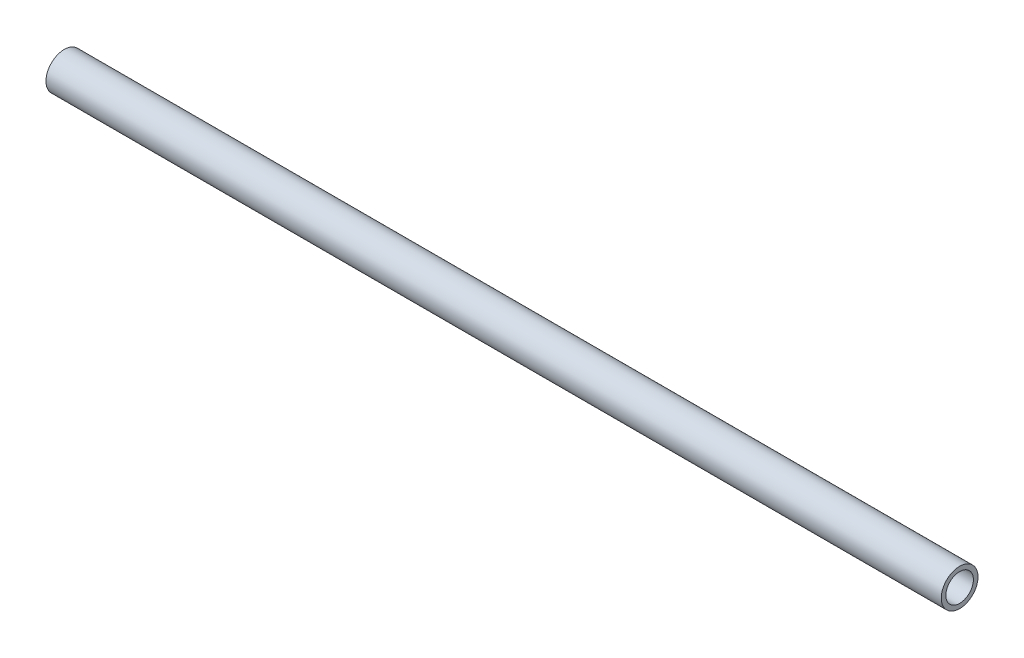
ISO-10303-21;
HEADER;
FILE_DESCRIPTION(('STEP AP214'),'2;1');
FILE_NAME('part.step','',(''),(''),'','','');
FILE_SCHEMA(('AUTOMOTIVE_DESIGN { 1 0 10303 214 1 1 1 1 }'));
ENDSEC;
DATA;
#1=APPLICATION_CONTEXT('core data for automotive mechanical design processes');
#2=APPLICATION_PROTOCOL_DEFINITION('international standard','automotive_design',2000,#1);
#3=PRODUCT_CONTEXT('',#1,'mechanical');
#4=PRODUCT('Part','Part','',(#3));
#5=PRODUCT_RELATED_PRODUCT_CATEGORY('part','',(#4));
#6=PRODUCT_DEFINITION_FORMATION('','',#4);
#7=PRODUCT_DEFINITION_CONTEXT('part definition',#1,'design');
#8=PRODUCT_DEFINITION('design','',#6,#7);
#9=PRODUCT_DEFINITION_SHAPE('','',#8);
#10=(LENGTH_UNIT() NAMED_UNIT(*) SI_UNIT(.MILLI.,.METRE.));
#11=(NAMED_UNIT(*) PLANE_ANGLE_UNIT() SI_UNIT($,.RADIAN.));
#12=(NAMED_UNIT(*) SI_UNIT($,.STERADIAN.) SOLID_ANGLE_UNIT());
#13=UNCERTAINTY_MEASURE_WITH_UNIT(LENGTH_MEASURE(1.E-05),#10,'distance_accuracy_value','');
#14=(GEOMETRIC_REPRESENTATION_CONTEXT(3) GLOBAL_UNCERTAINTY_ASSIGNED_CONTEXT((#13)) GLOBAL_UNIT_ASSIGNED_CONTEXT((#10,
#11,#12)) REPRESENTATION_CONTEXT('',''));
#15=CARTESIAN_POINT('',(0.,0.,0.));
#16=DIRECTION('',(0.,0.,1.));
#17=DIRECTION('',(1.,0.,0.));
#18=AXIS2_PLACEMENT_3D('',#15,#16,#17);
#19=CARTESIAN_POINT('',(309.5625,0.,0.));
#20=DIRECTION('',(1.,0.,0.));
#21=DIRECTION('',(0.,0.,-1.));
#22=AXIS2_PLACEMENT_3D('',#19,#20,#21);
#23=PLANE('',#22);
#24=CARTESIAN_POINT('',(309.5625,0.,0.));
#25=DIRECTION('',(1.,0.,0.));
#26=DIRECTION('',(0.,0.,-1.));
#27=AXIS2_PLACEMENT_3D('',#24,#25,#26);
#28=CIRCLE('',#27,12.7);
#29=CARTESIAN_POINT('',(309.5625,0.,-12.7));
#30=VERTEX_POINT('',#29);
#31=EDGE_CURVE('E10',#30,#30,#28,.T.);
#32=ORIENTED_EDGE('',*,*,#31,.T.);
#33=EDGE_LOOP('',(#32));
#34=FACE_BOUND('',#33,.T.);
#35=CARTESIAN_POINT('',(309.5625,0.,0.));
#36=DIRECTION('',(1.,0.,0.));
#37=DIRECTION('',(0.,0.,-1.));
#38=AXIS2_PLACEMENT_3D('',#35,#36,#37);
#39=CIRCLE('',#38,9.525);
#40=CARTESIAN_POINT('',(309.5625,0.,-9.525));
#41=VERTEX_POINT('',#40);
#42=EDGE_CURVE('E51',#41,#41,#39,.T.);
#43=ORIENTED_EDGE('',*,*,#42,.F.);
#44=EDGE_LOOP('',(#43));
#45=FACE_BOUND('',#44,.T.);
#46=ADVANCED_FACE('F37',(#34,#45),#23,.T.);
#47=CARTESIAN_POINT('',(-309.5625,0.,0.));
#48=DIRECTION('',(1.,0.,0.));
#49=DIRECTION('',(0.,0.,-1.));
#50=AXIS2_PLACEMENT_3D('',#47,#48,#49);
#51=PLANE('',#50);
#52=CARTESIAN_POINT('',(-309.5625,0.,0.));
#53=DIRECTION('',(1.,0.,0.));
#54=DIRECTION('',(0.,0.,-1.));
#55=AXIS2_PLACEMENT_3D('',#52,#53,#54);
#56=CIRCLE('',#55,12.7);
#57=CARTESIAN_POINT('',(-309.5625,0.,-12.7));
#58=VERTEX_POINT('',#57);
#59=EDGE_CURVE('E41',#58,#58,#56,.T.);
#60=ORIENTED_EDGE('',*,*,#59,.F.);
#61=EDGE_LOOP('',(#60));
#62=FACE_BOUND('',#61,.T.);
#63=CARTESIAN_POINT('',(-309.5625,0.,0.));
#64=DIRECTION('',(1.,0.,0.));
#65=DIRECTION('',(0.,0.,-1.));
#66=AXIS2_PLACEMENT_3D('',#63,#64,#65);
#67=CIRCLE('',#66,9.525);
#68=CARTESIAN_POINT('',(-309.5625,0.,-9.525));
#69=VERTEX_POINT('',#68);
#70=EDGE_CURVE('E53',#69,#69,#67,.T.);
#71=ORIENTED_EDGE('',*,*,#70,.T.);
#72=EDGE_LOOP('',(#71));
#73=FACE_BOUND('',#72,.T.);
#74=ADVANCED_FACE('F66',(#62,#73),#51,.F.);
#75=CARTESIAN_POINT('',(309.5625,0.,0.));
#76=DIRECTION('',(-1.,0.,0.));
#77=DIRECTION('',(0.,0.,1.));
#78=AXIS2_PLACEMENT_3D('',#75,#76,#77);
#79=CYLINDRICAL_SURFACE('',#78,12.7);
#80=ORIENTED_EDGE('',*,*,#31,.F.);
#81=EDGE_LOOP('',(#80));
#82=FACE_BOUND('',#81,.T.);
#83=ORIENTED_EDGE('',*,*,#59,.T.);
#84=EDGE_LOOP('',(#83));
#85=FACE_BOUND('',#84,.T.);
#86=ADVANCED_FACE('F39',(#82,#85),#79,.T.);
#87=CARTESIAN_POINT('',(309.5625,0.,0.));
#88=DIRECTION('',(-1.,0.,0.));
#89=DIRECTION('',(0.,0.,1.));
#90=AXIS2_PLACEMENT_3D('',#87,#88,#89);
#91=CYLINDRICAL_SURFACE('',#90,9.525);
#92=ORIENTED_EDGE('',*,*,#42,.T.);
#93=EDGE_LOOP('',(#92));
#94=FACE_BOUND('',#93,.T.);
#95=ORIENTED_EDGE('',*,*,#70,.F.);
#96=EDGE_LOOP('',(#95));
#97=FACE_BOUND('',#96,.T.);
#98=ADVANCED_FACE('F62',(#94,#97),#91,.F.);
#99=CLOSED_SHELL('',(#46,#74,#86,#98));
#100=MANIFOLD_SOLID_BREP('B2',#99);
#101=ADVANCED_BREP_SHAPE_REPRESENTATION('',(#18,#100),#14);
#102=SHAPE_DEFINITION_REPRESENTATION(#9,#101);
ENDSEC;
END-ISO-10303-21;
